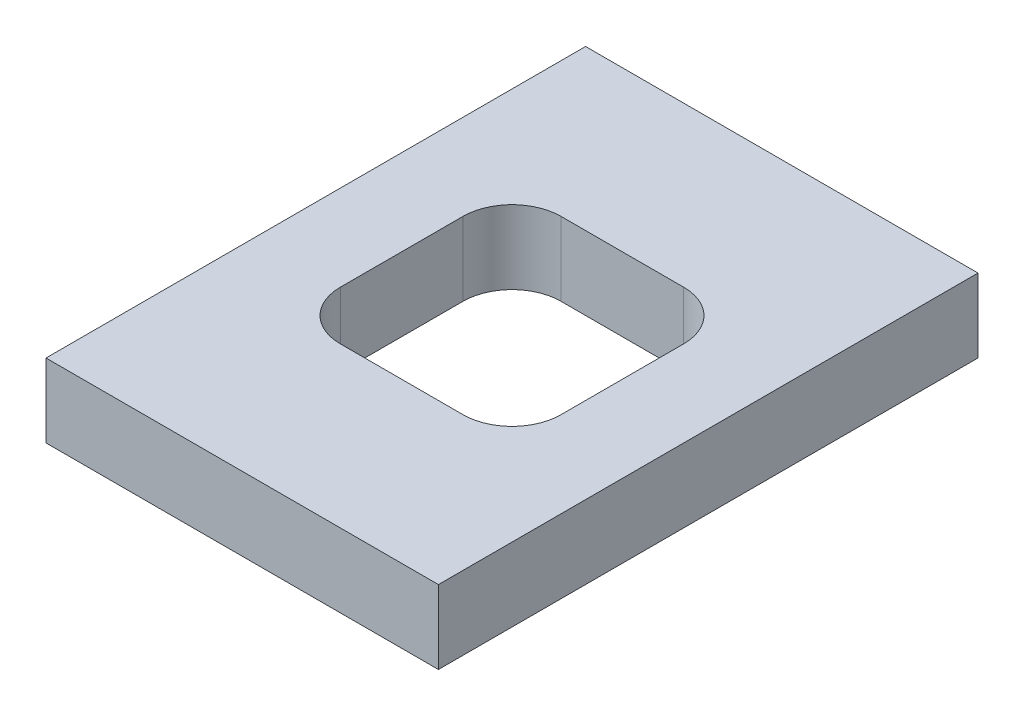
ISO-10303-21;
HEADER;
FILE_DESCRIPTION(('STEP AP214'),'2;1');
FILE_NAME('part.step','',(''),(''),'','','');
FILE_SCHEMA(('AUTOMOTIVE_DESIGN { 1 0 10303 214 1 1 1 1 }'));
ENDSEC;
DATA;
#1=APPLICATION_CONTEXT('core data for automotive mechanical design processes');
#2=APPLICATION_PROTOCOL_DEFINITION('international standard','automotive_design',2000,#1);
#3=PRODUCT_CONTEXT('',#1,'mechanical');
#4=PRODUCT('Part','Part','',(#3));
#5=PRODUCT_RELATED_PRODUCT_CATEGORY('part','',(#4));
#6=PRODUCT_DEFINITION_FORMATION('','',#4);
#7=PRODUCT_DEFINITION_CONTEXT('part definition',#1,'design');
#8=PRODUCT_DEFINITION('design','',#6,#7);
#9=PRODUCT_DEFINITION_SHAPE('','',#8);
#10=(LENGTH_UNIT() NAMED_UNIT(*) SI_UNIT(.MILLI.,.METRE.));
#11=(NAMED_UNIT(*) PLANE_ANGLE_UNIT() SI_UNIT($,.RADIAN.));
#12=(NAMED_UNIT(*) SI_UNIT($,.STERADIAN.) SOLID_ANGLE_UNIT());
#13=UNCERTAINTY_MEASURE_WITH_UNIT(LENGTH_MEASURE(1.E-05),#10,'distance_accuracy_value','');
#14=(GEOMETRIC_REPRESENTATION_CONTEXT(3) GLOBAL_UNCERTAINTY_ASSIGNED_CONTEXT((#13)) GLOBAL_UNIT_ASSIGNED_CONTEXT((#10,
#11,#12)) REPRESENTATION_CONTEXT('',''));
#15=CARTESIAN_POINT('',(0.,0.,0.));
#16=DIRECTION('',(0.,0.,1.));
#17=DIRECTION('',(1.,0.,0.));
#18=AXIS2_PLACEMENT_3D('',#15,#16,#17);
#19=CARTESIAN_POINT('',(0.,1.5,0.));
#20=DIRECTION('',(0.,1.,0.));
#21=DIRECTION('',(0.,0.,1.));
#22=AXIS2_PLACEMENT_3D('',#19,#20,#21);
#23=PLANE('',#22);
#24=DIRECTION('',(0.,0.,1.));
#25=VECTOR('',#24,1.);
#26=CARTESIAN_POINT('',(-8.,1.5,-11.));
#27=LINE('',#26,#25);
#28=CARTESIAN_POINT('',(-8.,1.5,-11.));
#29=VERTEX_POINT('',#28);
#30=CARTESIAN_POINT('',(-8.,1.5,11.));
#31=VERTEX_POINT('',#30);
#32=EDGE_CURVE('E138',#29,#31,#27,.T.);
#33=ORIENTED_EDGE('',*,*,#32,.T.);
#34=DIRECTION('',(1.,0.,0.));
#35=VECTOR('',#34,1.);
#36=CARTESIAN_POINT('',(-8.,1.5,11.));
#37=LINE('',#36,#35);
#38=CARTESIAN_POINT('',(8.,1.5,11.));
#39=VERTEX_POINT('',#38);
#40=EDGE_CURVE('E127',#31,#39,#37,.T.);
#41=ORIENTED_EDGE('',*,*,#40,.T.);
#42=DIRECTION('',(0.,0.,-1.));
#43=VECTOR('',#42,1.);
#44=CARTESIAN_POINT('',(8.,1.5,-11.));
#45=LINE('',#44,#43);
#46=CARTESIAN_POINT('',(8.,1.5,-11.));
#47=VERTEX_POINT('',#46);
#48=EDGE_CURVE('E137',#39,#47,#45,.T.);
#49=ORIENTED_EDGE('',*,*,#48,.T.);
#50=DIRECTION('',(-1.,0.,0.));
#51=VECTOR('',#50,1.);
#52=CARTESIAN_POINT('',(-8.,1.5,-11.));
#53=LINE('',#52,#51);
#54=EDGE_CURVE('E142',#47,#29,#53,.T.);
#55=ORIENTED_EDGE('',*,*,#54,.T.);
#56=EDGE_LOOP('',(#33,#41,#49,#55));
#57=FACE_BOUND('',#56,.T.);
#58=DIRECTION('',(1.,0.,0.));
#59=VECTOR('',#58,1.);
#60=CARTESIAN_POINT('',(-4.5,1.5,4.5));
#61=LINE('',#60,#59);
#62=CARTESIAN_POINT('',(-2.5,1.5,4.5));
#63=VERTEX_POINT('',#62);
#64=CARTESIAN_POINT('',(2.5,1.5,4.5));
#65=VERTEX_POINT('',#64);
#66=EDGE_CURVE('E204',#63,#65,#61,.T.);
#67=ORIENTED_EDGE('',*,*,#66,.F.);
#68=CARTESIAN_POINT('',(-2.5,1.5,2.5));
#69=DIRECTION('',(0.,1.,0.));
#70=DIRECTION('',(0.,0.,1.));
#71=AXIS2_PLACEMENT_3D('',#68,#69,#70);
#72=CIRCLE('',#71,2.);
#73=CARTESIAN_POINT('',(-4.5,1.5,2.5));
#74=VERTEX_POINT('',#73);
#75=EDGE_CURVE('E11',#63,#74,#72,.F.);
#76=ORIENTED_EDGE('',*,*,#75,.T.);
#77=DIRECTION('',(0.,0.,1.));
#78=VECTOR('',#77,1.);
#79=CARTESIAN_POINT('',(-4.5,1.5,-4.5));
#80=LINE('',#79,#78);
#81=CARTESIAN_POINT('',(-4.5,1.5,-2.5));
#82=VERTEX_POINT('',#81);
#83=EDGE_CURVE('E202',#82,#74,#80,.T.);
#84=ORIENTED_EDGE('',*,*,#83,.F.);
#85=CARTESIAN_POINT('',(-2.5,1.5,-2.5));
#86=DIRECTION('',(0.,1.,0.));
#87=DIRECTION('',(0.,0.,1.));
#88=AXIS2_PLACEMENT_3D('',#85,#86,#87);
#89=CIRCLE('',#88,2.);
#90=CARTESIAN_POINT('',(-2.5,1.5,-4.5));
#91=VERTEX_POINT('',#90);
#92=EDGE_CURVE('E177',#82,#91,#89,.F.);
#93=ORIENTED_EDGE('',*,*,#92,.T.);
#94=DIRECTION('',(-1.,0.,0.));
#95=VECTOR('',#94,1.);
#96=CARTESIAN_POINT('',(-4.5,1.5,-4.5));
#97=LINE('',#96,#95);
#98=CARTESIAN_POINT('',(2.5,1.5,-4.5));
#99=VERTEX_POINT('',#98);
#100=EDGE_CURVE('E216',#99,#91,#97,.T.);
#101=ORIENTED_EDGE('',*,*,#100,.F.);
#102=CARTESIAN_POINT('',(2.5,1.5,-2.5));
#103=DIRECTION('',(0.,1.,0.));
#104=DIRECTION('',(0.,0.,1.));
#105=AXIS2_PLACEMENT_3D('',#102,#103,#104);
#106=CIRCLE('',#105,2.);
#107=CARTESIAN_POINT('',(4.5,1.5,-2.5));
#108=VERTEX_POINT('',#107);
#109=EDGE_CURVE('E181',#99,#108,#106,.F.);
#110=ORIENTED_EDGE('',*,*,#109,.T.);
#111=DIRECTION('',(0.,0.,-1.));
#112=VECTOR('',#111,1.);
#113=CARTESIAN_POINT('',(4.5,1.5,-4.5));
#114=LINE('',#113,#112);
#115=CARTESIAN_POINT('',(4.5,1.5,2.5));
#116=VERTEX_POINT('',#115);
#117=EDGE_CURVE('E210',#116,#108,#114,.T.);
#118=ORIENTED_EDGE('',*,*,#117,.F.);
#119=CARTESIAN_POINT('',(2.5,1.5,2.5));
#120=DIRECTION('',(0.,1.,0.));
#121=DIRECTION('',(0.,0.,1.));
#122=AXIS2_PLACEMENT_3D('',#119,#120,#121);
#123=CIRCLE('',#122,2.);
#124=EDGE_CURVE('E52',#116,#65,#123,.F.);
#125=ORIENTED_EDGE('',*,*,#124,.T.);
#126=EDGE_LOOP('',(#67,#76,#84,#93,#101,#110,#118,#125));
#127=FACE_BOUND('',#126,.T.);
#128=ADVANCED_FACE('F37',(#57,#127),#23,.T.);
#129=CARTESIAN_POINT('',(0.,-1.5,0.));
#130=DIRECTION('',(0.,1.,0.));
#131=DIRECTION('',(0.,0.,1.));
#132=AXIS2_PLACEMENT_3D('',#129,#130,#131);
#133=PLANE('',#132);
#134=DIRECTION('',(0.,0.,1.));
#135=VECTOR('',#134,1.);
#136=CARTESIAN_POINT('',(-8.,-1.5,-11.));
#137=LINE('',#136,#135);
#138=CARTESIAN_POINT('',(-8.,-1.5,-11.));
#139=VERTEX_POINT('',#138);
#140=CARTESIAN_POINT('',(-8.,-1.5,11.));
#141=VERTEX_POINT('',#140);
#142=EDGE_CURVE('E150',#139,#141,#137,.T.);
#143=ORIENTED_EDGE('',*,*,#142,.F.);
#144=DIRECTION('',(-1.,0.,0.));
#145=VECTOR('',#144,1.);
#146=CARTESIAN_POINT('',(-8.,-1.5,-11.));
#147=LINE('',#146,#145);
#148=CARTESIAN_POINT('',(8.,-1.5,-11.));
#149=VERTEX_POINT('',#148);
#150=EDGE_CURVE('E146',#149,#139,#147,.T.);
#151=ORIENTED_EDGE('',*,*,#150,.F.);
#152=DIRECTION('',(0.,0.,-1.));
#153=VECTOR('',#152,1.);
#154=CARTESIAN_POINT('',(8.,-1.5,-11.));
#155=LINE('',#154,#153);
#156=CARTESIAN_POINT('',(8.,-1.5,11.));
#157=VERTEX_POINT('',#156);
#158=EDGE_CURVE('E228',#157,#149,#155,.T.);
#159=ORIENTED_EDGE('',*,*,#158,.F.);
#160=DIRECTION('',(1.,0.,0.));
#161=VECTOR('',#160,1.);
#162=CARTESIAN_POINT('',(-8.,-1.5,11.));
#163=LINE('',#162,#161);
#164=EDGE_CURVE('E226',#141,#157,#163,.T.);
#165=ORIENTED_EDGE('',*,*,#164,.F.);
#166=EDGE_LOOP('',(#143,#151,#159,#165));
#167=FACE_BOUND('',#166,.T.);
#168=DIRECTION('',(-1.,0.,0.));
#169=VECTOR('',#168,1.);
#170=CARTESIAN_POINT('',(-4.5,-1.5,-4.5));
#171=LINE('',#170,#169);
#172=CARTESIAN_POINT('',(2.5,-1.5,-4.5));
#173=VERTEX_POINT('',#172);
#174=CARTESIAN_POINT('',(-2.5,-1.5,-4.5));
#175=VERTEX_POINT('',#174);
#176=EDGE_CURVE('E208',#173,#175,#171,.T.);
#177=ORIENTED_EDGE('',*,*,#176,.T.);
#178=CARTESIAN_POINT('',(-2.5,-1.5,-2.5));
#179=DIRECTION('',(0.,1.,0.));
#180=DIRECTION('',(0.,0.,1.));
#181=AXIS2_PLACEMENT_3D('',#178,#179,#180);
#182=CIRCLE('',#181,2.);
#183=CARTESIAN_POINT('',(-4.5,-1.5,-2.5));
#184=VERTEX_POINT('',#183);
#185=EDGE_CURVE('E175',#175,#184,#182,.T.);
#186=ORIENTED_EDGE('',*,*,#185,.T.);
#187=DIRECTION('',(0.,0.,1.));
#188=VECTOR('',#187,1.);
#189=CARTESIAN_POINT('',(-4.5,-1.5,-4.5));
#190=LINE('',#189,#188);
#191=CARTESIAN_POINT('',(-4.5,-1.5,2.5));
#192=VERTEX_POINT('',#191);
#193=EDGE_CURVE('E192',#184,#192,#190,.T.);
#194=ORIENTED_EDGE('',*,*,#193,.T.);
#195=CARTESIAN_POINT('',(-2.5,-1.5,2.5));
#196=DIRECTION('',(0.,1.,0.));
#197=DIRECTION('',(0.,0.,1.));
#198=AXIS2_PLACEMENT_3D('',#195,#196,#197);
#199=CIRCLE('',#198,2.);
#200=CARTESIAN_POINT('',(-2.5,-1.5,4.5));
#201=VERTEX_POINT('',#200);
#202=EDGE_CURVE('E45',#192,#201,#199,.T.);
#203=ORIENTED_EDGE('',*,*,#202,.T.);
#204=DIRECTION('',(1.,0.,0.));
#205=VECTOR('',#204,1.);
#206=CARTESIAN_POINT('',(-4.5,-1.5,4.5));
#207=LINE('',#206,#205);
#208=CARTESIAN_POINT('',(2.5,-1.5,4.5));
#209=VERTEX_POINT('',#208);
#210=EDGE_CURVE('E190',#201,#209,#207,.T.);
#211=ORIENTED_EDGE('',*,*,#210,.T.);
#212=CARTESIAN_POINT('',(2.5,-1.5,2.5));
#213=DIRECTION('',(0.,1.,0.));
#214=DIRECTION('',(0.,0.,1.));
#215=AXIS2_PLACEMENT_3D('',#212,#213,#214);
#216=CIRCLE('',#215,2.);
#217=CARTESIAN_POINT('',(4.5,-1.5,2.5));
#218=VERTEX_POINT('',#217);
#219=EDGE_CURVE('E183',#209,#218,#216,.T.);
#220=ORIENTED_EDGE('',*,*,#219,.T.);
#221=DIRECTION('',(0.,0.,-1.));
#222=VECTOR('',#221,1.);
#223=CARTESIAN_POINT('',(4.5,-1.5,-4.5));
#224=LINE('',#223,#222);
#225=CARTESIAN_POINT('',(4.5,-1.5,-2.5));
#226=VERTEX_POINT('',#225);
#227=EDGE_CURVE('E197',#218,#226,#224,.T.);
#228=ORIENTED_EDGE('',*,*,#227,.T.);
#229=CARTESIAN_POINT('',(2.5,-1.5,-2.5));
#230=DIRECTION('',(0.,1.,0.));
#231=DIRECTION('',(0.,0.,1.));
#232=AXIS2_PLACEMENT_3D('',#229,#230,#231);
#233=CIRCLE('',#232,2.);
#234=EDGE_CURVE('E179',#226,#173,#233,.T.);
#235=ORIENTED_EDGE('',*,*,#234,.T.);
#236=EDGE_LOOP('',(#177,#186,#194,#203,#211,#220,#228,#235));
#237=FACE_BOUND('',#236,.T.);
#238=ADVANCED_FACE('F189',(#167,#237),#133,.F.);
#239=CARTESIAN_POINT('',(-8.,1.5,-11.));
#240=DIRECTION('',(1.,0.,0.));
#241=DIRECTION('',(0.,0.,-1.));
#242=AXIS2_PLACEMENT_3D('',#239,#240,#241);
#243=PLANE('',#242);
#244=ORIENTED_EDGE('',*,*,#142,.T.);
#245=DIRECTION('',(0.,-1.,0.));
#246=VECTOR('',#245,1.);
#247=CARTESIAN_POINT('',(-8.,1.5,11.));
#248=LINE('',#247,#246);
#249=EDGE_CURVE('E131',#31,#141,#248,.T.);
#250=ORIENTED_EDGE('',*,*,#249,.F.);
#251=ORIENTED_EDGE('',*,*,#32,.F.);
#252=DIRECTION('',(0.,-1.,0.));
#253=VECTOR('',#252,1.);
#254=CARTESIAN_POINT('',(-8.,1.5,-11.));
#255=LINE('',#254,#253);
#256=EDGE_CURVE('E224',#29,#139,#255,.T.);
#257=ORIENTED_EDGE('',*,*,#256,.T.);
#258=EDGE_LOOP('',(#244,#250,#251,#257));
#259=FACE_BOUND('',#258,.T.);
#260=ADVANCED_FACE('F148',(#259),#243,.F.);
#261=CARTESIAN_POINT('',(-8.,1.5,11.));
#262=DIRECTION('',(0.,0.,-1.));
#263=DIRECTION('',(-1.,0.,0.));
#264=AXIS2_PLACEMENT_3D('',#261,#262,#263);
#265=PLANE('',#264);
#266=ORIENTED_EDGE('',*,*,#164,.T.);
#267=DIRECTION('',(0.,-1.,0.));
#268=VECTOR('',#267,1.);
#269=CARTESIAN_POINT('',(8.,1.5,11.));
#270=LINE('',#269,#268);
#271=EDGE_CURVE('E134',#39,#157,#270,.T.);
#272=ORIENTED_EDGE('',*,*,#271,.F.);
#273=ORIENTED_EDGE('',*,*,#40,.F.);
#274=ORIENTED_EDGE('',*,*,#249,.T.);
#275=EDGE_LOOP('',(#266,#272,#273,#274));
#276=FACE_BOUND('',#275,.T.);
#277=ADVANCED_FACE('F129',(#276),#265,.F.);
#278=CARTESIAN_POINT('',(8.,1.5,-11.));
#279=DIRECTION('',(-1.,0.,0.));
#280=DIRECTION('',(0.,0.,1.));
#281=AXIS2_PLACEMENT_3D('',#278,#279,#280);
#282=PLANE('',#281);
#283=ORIENTED_EDGE('',*,*,#158,.T.);
#284=DIRECTION('',(0.,-1.,0.));
#285=VECTOR('',#284,1.);
#286=CARTESIAN_POINT('',(8.,1.5,-11.));
#287=LINE('',#286,#285);
#288=EDGE_CURVE('E155',#47,#149,#287,.T.);
#289=ORIENTED_EDGE('',*,*,#288,.F.);
#290=ORIENTED_EDGE('',*,*,#48,.F.);
#291=ORIENTED_EDGE('',*,*,#271,.T.);
#292=EDGE_LOOP('',(#283,#289,#290,#291));
#293=FACE_BOUND('',#292,.T.);
#294=ADVANCED_FACE('F239',(#293),#282,.F.);
#295=CARTESIAN_POINT('',(-8.,1.5,-11.));
#296=DIRECTION('',(0.,0.,1.));
#297=DIRECTION('',(1.,0.,0.));
#298=AXIS2_PLACEMENT_3D('',#295,#296,#297);
#299=PLANE('',#298);
#300=ORIENTED_EDGE('',*,*,#150,.T.);
#301=ORIENTED_EDGE('',*,*,#256,.F.);
#302=ORIENTED_EDGE('',*,*,#54,.F.);
#303=ORIENTED_EDGE('',*,*,#288,.T.);
#304=EDGE_LOOP('',(#300,#301,#302,#303));
#305=FACE_BOUND('',#304,.T.);
#306=ADVANCED_FACE('F235',(#305),#299,.F.);
#307=CARTESIAN_POINT('',(-4.5,1.5,-4.5));
#308=DIRECTION('',(1.,0.,0.));
#309=DIRECTION('',(0.,0.,-1.));
#310=AXIS2_PLACEMENT_3D('',#307,#308,#309);
#311=PLANE('',#310);
#312=ORIENTED_EDGE('',*,*,#193,.F.);
#313=DIRECTION('',(0.,-1.,0.));
#314=VECTOR('',#313,1.);
#315=CARTESIAN_POINT('',(-4.5,1.5,-2.5));
#316=LINE('',#315,#314);
#317=EDGE_CURVE('E164',#184,#82,#316,.F.);
#318=ORIENTED_EDGE('',*,*,#317,.T.);
#319=ORIENTED_EDGE('',*,*,#83,.T.);
#320=DIRECTION('',(0.,-1.,0.));
#321=VECTOR('',#320,1.);
#322=CARTESIAN_POINT('',(-4.5,-1.5,2.5));
#323=LINE('',#322,#321);
#324=EDGE_CURVE('E161',#74,#192,#323,.T.);
#325=ORIENTED_EDGE('',*,*,#324,.T.);
#326=EDGE_LOOP('',(#312,#318,#319,#325));
#327=FACE_BOUND('',#326,.T.);
#328=ADVANCED_FACE('F206',(#327),#311,.T.);
#329=CARTESIAN_POINT('',(-4.5,1.5,4.5));
#330=DIRECTION('',(0.,0.,-1.));
#331=DIRECTION('',(-1.,0.,0.));
#332=AXIS2_PLACEMENT_3D('',#329,#330,#331);
#333=PLANE('',#332);
#334=ORIENTED_EDGE('',*,*,#66,.T.);
#335=DIRECTION('',(0.,-1.,0.));
#336=VECTOR('',#335,1.);
#337=CARTESIAN_POINT('',(2.5,-1.5,4.5));
#338=LINE('',#337,#336);
#339=EDGE_CURVE('E172',#65,#209,#338,.T.);
#340=ORIENTED_EDGE('',*,*,#339,.T.);
#341=ORIENTED_EDGE('',*,*,#210,.F.);
#342=DIRECTION('',(0.,-1.,0.));
#343=VECTOR('',#342,1.);
#344=CARTESIAN_POINT('',(-2.5,1.5,4.5));
#345=LINE('',#344,#343);
#346=EDGE_CURVE('E59',#201,#63,#345,.F.);
#347=ORIENTED_EDGE('',*,*,#346,.T.);
#348=EDGE_LOOP('',(#334,#340,#341,#347));
#349=FACE_BOUND('',#348,.T.);
#350=ADVANCED_FACE('F195',(#349),#333,.T.);
#351=CARTESIAN_POINT('',(4.5,1.5,-4.5));
#352=DIRECTION('',(-1.,0.,0.));
#353=DIRECTION('',(0.,0.,1.));
#354=AXIS2_PLACEMENT_3D('',#351,#352,#353);
#355=PLANE('',#354);
#356=ORIENTED_EDGE('',*,*,#117,.T.);
#357=DIRECTION('',(0.,-1.,0.));
#358=VECTOR('',#357,1.);
#359=CARTESIAN_POINT('',(4.5,-1.5,-2.5));
#360=LINE('',#359,#358);
#361=EDGE_CURVE('E168',#108,#226,#360,.T.);
#362=ORIENTED_EDGE('',*,*,#361,.T.);
#363=ORIENTED_EDGE('',*,*,#227,.F.);
#364=DIRECTION('',(0.,-1.,0.));
#365=VECTOR('',#364,1.);
#366=CARTESIAN_POINT('',(4.5,1.5,2.5));
#367=LINE('',#366,#365);
#368=EDGE_CURVE('E166',#218,#116,#367,.F.);
#369=ORIENTED_EDGE('',*,*,#368,.T.);
#370=EDGE_LOOP('',(#356,#362,#363,#369));
#371=FACE_BOUND('',#370,.T.);
#372=ADVANCED_FACE('F259',(#371),#355,.T.);
#373=CARTESIAN_POINT('',(-4.5,1.5,-4.5));
#374=DIRECTION('',(0.,0.,1.));
#375=DIRECTION('',(1.,0.,0.));
#376=AXIS2_PLACEMENT_3D('',#373,#374,#375);
#377=PLANE('',#376);
#378=ORIENTED_EDGE('',*,*,#100,.T.);
#379=DIRECTION('',(0.,-1.,0.));
#380=VECTOR('',#379,1.);
#381=CARTESIAN_POINT('',(-2.5,-1.5,-4.5));
#382=LINE('',#381,#380);
#383=EDGE_CURVE('E153',#91,#175,#382,.T.);
#384=ORIENTED_EDGE('',*,*,#383,.T.);
#385=ORIENTED_EDGE('',*,*,#176,.F.);
#386=DIRECTION('',(0.,-1.,0.));
#387=VECTOR('',#386,1.);
#388=CARTESIAN_POINT('',(2.5,1.5,-4.5));
#389=LINE('',#388,#387);
#390=EDGE_CURVE('E151',#173,#99,#389,.F.);
#391=ORIENTED_EDGE('',*,*,#390,.T.);
#392=EDGE_LOOP('',(#378,#384,#385,#391));
#393=FACE_BOUND('',#392,.T.);
#394=ADVANCED_FACE('F262',(#393),#377,.T.);
#395=CARTESIAN_POINT('',(-2.5,1.5,-2.5));
#396=DIRECTION('',(0.,1.,0.));
#397=DIRECTION('',(0.,0.,1.));
#398=AXIS2_PLACEMENT_3D('',#395,#396,#397);
#399=CYLINDRICAL_SURFACE('',#398,2.);
#400=ORIENTED_EDGE('',*,*,#92,.F.);
#401=ORIENTED_EDGE('',*,*,#317,.F.);
#402=ORIENTED_EDGE('',*,*,#185,.F.);
#403=ORIENTED_EDGE('',*,*,#383,.F.);
#404=EDGE_LOOP('',(#400,#401,#402,#403));
#405=FACE_BOUND('',#404,.T.);
#406=ADVANCED_FACE('F265',(#405),#399,.F.);
#407=CARTESIAN_POINT('',(2.5,1.5,-2.5));
#408=DIRECTION('',(0.,1.,0.));
#409=DIRECTION('',(0.,0.,1.));
#410=AXIS2_PLACEMENT_3D('',#407,#408,#409);
#411=CYLINDRICAL_SURFACE('',#410,2.);
#412=ORIENTED_EDGE('',*,*,#109,.F.);
#413=ORIENTED_EDGE('',*,*,#390,.F.);
#414=ORIENTED_EDGE('',*,*,#234,.F.);
#415=ORIENTED_EDGE('',*,*,#361,.F.);
#416=EDGE_LOOP('',(#412,#413,#414,#415));
#417=FACE_BOUND('',#416,.T.);
#418=ADVANCED_FACE('F270',(#417),#411,.F.);
#419=CARTESIAN_POINT('',(2.5,1.5,2.5));
#420=DIRECTION('',(0.,1.,0.));
#421=DIRECTION('',(0.,0.,1.));
#422=AXIS2_PLACEMENT_3D('',#419,#420,#421);
#423=CYLINDRICAL_SURFACE('',#422,2.);
#424=ORIENTED_EDGE('',*,*,#124,.F.);
#425=ORIENTED_EDGE('',*,*,#368,.F.);
#426=ORIENTED_EDGE('',*,*,#219,.F.);
#427=ORIENTED_EDGE('',*,*,#339,.F.);
#428=EDGE_LOOP('',(#424,#425,#426,#427));
#429=FACE_BOUND('',#428,.T.);
#430=ADVANCED_FACE('F283',(#429),#423,.F.);
#431=CARTESIAN_POINT('',(-2.5,1.5,2.5));
#432=DIRECTION('',(0.,1.,0.));
#433=DIRECTION('',(0.,0.,1.));
#434=AXIS2_PLACEMENT_3D('',#431,#432,#433);
#435=CYLINDRICAL_SURFACE('',#434,2.);
#436=ORIENTED_EDGE('',*,*,#75,.F.);
#437=ORIENTED_EDGE('',*,*,#346,.F.);
#438=ORIENTED_EDGE('',*,*,#202,.F.);
#439=ORIENTED_EDGE('',*,*,#324,.F.);
#440=EDGE_LOOP('',(#436,#437,#438,#439));
#441=FACE_BOUND('',#440,.T.);
#442=ADVANCED_FACE('F39',(#441),#435,.F.);
#443=CLOSED_SHELL('',(#128,#238,#260,#277,#294,#306,#328,#350,#372,#394,#406,#418,#430,#442));
#444=MANIFOLD_SOLID_BREP('B2',#443);
#445=ADVANCED_BREP_SHAPE_REPRESENTATION('',(#18,#444),#14);
#446=SHAPE_DEFINITION_REPRESENTATION(#9,#445);
ENDSEC;
END-ISO-10303-21;
